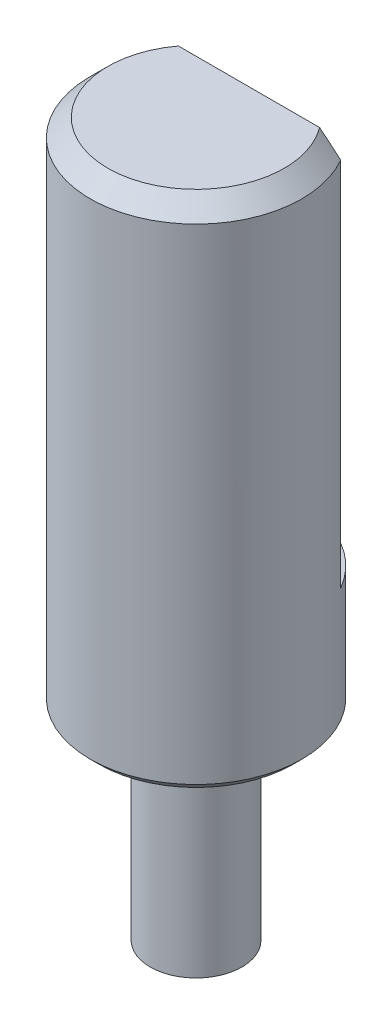
ISO-10303-21;
HEADER;
FILE_DESCRIPTION(('STEP AP214'),'2;1');
FILE_NAME('part.step','',(''),(''),'','','');
FILE_SCHEMA(('AUTOMOTIVE_DESIGN { 1 0 10303 214 1 1 1 1 }'));
ENDSEC;
DATA;
#1=APPLICATION_CONTEXT('core data for automotive mechanical design processes');
#2=APPLICATION_PROTOCOL_DEFINITION('international standard','automotive_design',2000,#1);
#3=PRODUCT_CONTEXT('',#1,'mechanical');
#4=PRODUCT('Part','Part','',(#3));
#5=PRODUCT_RELATED_PRODUCT_CATEGORY('part','',(#4));
#6=PRODUCT_DEFINITION_FORMATION('','',#4);
#7=PRODUCT_DEFINITION_CONTEXT('part definition',#1,'design');
#8=PRODUCT_DEFINITION('design','',#6,#7);
#9=PRODUCT_DEFINITION_SHAPE('','',#8);
#10=(LENGTH_UNIT() NAMED_UNIT(*) SI_UNIT(.MILLI.,.METRE.));
#11=(NAMED_UNIT(*) PLANE_ANGLE_UNIT() SI_UNIT($,.RADIAN.));
#12=(NAMED_UNIT(*) SI_UNIT($,.STERADIAN.) SOLID_ANGLE_UNIT());
#13=UNCERTAINTY_MEASURE_WITH_UNIT(LENGTH_MEASURE(1.E-05),#10,'distance_accuracy_value','');
#14=(GEOMETRIC_REPRESENTATION_CONTEXT(3) GLOBAL_UNCERTAINTY_ASSIGNED_CONTEXT((#13)) GLOBAL_UNIT_ASSIGNED_CONTEXT((#10,
#11,#12)) REPRESENTATION_CONTEXT('',''));
#15=CARTESIAN_POINT('',(0.,0.,0.));
#16=DIRECTION('',(0.,0.,1.));
#17=DIRECTION('',(1.,0.,0.));
#18=AXIS2_PLACEMENT_3D('',#15,#16,#17);
#19=CARTESIAN_POINT('',(0.,5.7,0.));
#20=DIRECTION('',(0.,-1.,0.));
#21=DIRECTION('',(0.,0.,-1.));
#22=AXIS2_PLACEMENT_3D('',#19,#20,#21);
#23=CYLINDRICAL_SURFACE('',#22,1.3);
#24=CARTESIAN_POINT('',(0.,5.7,0.));
#25=DIRECTION('',(0.,1.,0.));
#26=DIRECTION('',(0.,0.,1.));
#27=AXIS2_PLACEMENT_3D('',#24,#25,#26);
#28=CIRCLE('',#27,1.3);
#29=CARTESIAN_POINT('',(0.,5.7,1.3));
#30=VERTEX_POINT('',#29);
#31=EDGE_CURVE('E86',#30,#30,#28,.T.);
#32=ORIENTED_EDGE('',*,*,#31,.F.);
#33=EDGE_LOOP('',(#32));
#34=FACE_BOUND('',#33,.T.);
#35=CARTESIAN_POINT('',(0.,0.,0.));
#36=DIRECTION('',(0.,1.,0.));
#37=DIRECTION('',(0.,0.,1.));
#38=AXIS2_PLACEMENT_3D('',#35,#36,#37);
#39=CIRCLE('',#38,1.3);
#40=CARTESIAN_POINT('',(0.,0.,1.3));
#41=VERTEX_POINT('',#40);
#42=EDGE_CURVE('E82',#41,#41,#39,.T.);
#43=ORIENTED_EDGE('',*,*,#42,.T.);
#44=EDGE_LOOP('',(#43));
#45=FACE_BOUND('',#44,.T.);
#46=ADVANCED_FACE('F34',(#34,#45),#23,.T.);
#47=CARTESIAN_POINT('',(0.,0.,0.));
#48=DIRECTION('',(0.,1.,0.));
#49=DIRECTION('',(0.,0.,1.));
#50=AXIS2_PLACEMENT_3D('',#47,#48,#49);
#51=PLANE('',#50);
#52=ORIENTED_EDGE('',*,*,#42,.F.);
#53=EDGE_LOOP('',(#52));
#54=FACE_BOUND('',#53,.T.);
#55=ADVANCED_FACE('F126',(#54),#51,.F.);
#56=CARTESIAN_POINT('',(0.,20.2,0.));
#57=DIRECTION('',(0.,-1.,0.));
#58=DIRECTION('',(0.,0.,-1.));
#59=AXIS2_PLACEMENT_3D('',#56,#57,#58);
#60=CYLINDRICAL_SURFACE('',#59,3.);
#61=DIRECTION('',(0.,1.,0.));
#62=VECTOR('',#61,1.);
#63=CARTESIAN_POINT('',(2.59807621135332,9.2,-1.5));
#64=LINE('',#63,#62);
#65=CARTESIAN_POINT('',(2.59807621135332,9.2,-1.5));
#66=VERTEX_POINT('',#65);
#67=CARTESIAN_POINT('',(2.59807621135332,19.7,-1.5));
#68=VERTEX_POINT('',#67);
#69=EDGE_CURVE('E77',#66,#68,#64,.T.);
#70=ORIENTED_EDGE('',*,*,#69,.T.);
#71=CARTESIAN_POINT('',(0.,19.7,0.));
#72=DIRECTION('',(0.,1.,0.));
#73=DIRECTION('',(0.,0.,1.));
#74=AXIS2_PLACEMENT_3D('',#71,#72,#73);
#75=CIRCLE('',#74,3.);
#76=CARTESIAN_POINT('',(-2.59807621135332,19.7,-1.5));
#77=VERTEX_POINT('',#76);
#78=EDGE_CURVE('E11',#68,#77,#75,.F.);
#79=ORIENTED_EDGE('',*,*,#78,.T.);
#80=DIRECTION('',(0.,1.,0.));
#81=VECTOR('',#80,1.);
#82=CARTESIAN_POINT('',(-2.59807621135332,9.2,-1.5));
#83=LINE('',#82,#81);
#84=CARTESIAN_POINT('',(-2.59807621135332,9.2,-1.5));
#85=VERTEX_POINT('',#84);
#86=EDGE_CURVE('E75',#85,#77,#83,.T.);
#87=ORIENTED_EDGE('',*,*,#86,.F.);
#88=CARTESIAN_POINT('',(0.,9.2,0.));
#89=DIRECTION('',(0.,1.,0.));
#90=DIRECTION('',(0.,0.,1.));
#91=AXIS2_PLACEMENT_3D('',#88,#89,#90);
#92=CIRCLE('',#91,3.);
#93=EDGE_CURVE('E68',#66,#85,#92,.T.);
#94=ORIENTED_EDGE('',*,*,#93,.F.);
#95=EDGE_LOOP('',(#70,#79,#87,#94));
#96=FACE_BOUND('',#95,.T.);
#97=CARTESIAN_POINT('',(0.,5.95000000000001,0.));
#98=DIRECTION('',(0.,1.,0.));
#99=DIRECTION('',(0.,0.,1.));
#100=AXIS2_PLACEMENT_3D('',#97,#98,#99);
#101=CIRCLE('',#100,3.);
#102=CARTESIAN_POINT('',(0.,5.95000000000001,3.));
#103=VERTEX_POINT('',#102);
#104=EDGE_CURVE('E89',#103,#103,#101,.T.);
#105=ORIENTED_EDGE('',*,*,#104,.T.);
#106=EDGE_LOOP('',(#105));
#107=FACE_BOUND('',#106,.T.);
#108=ADVANCED_FACE('F79',(#96,#107),#60,.T.);
#109=CARTESIAN_POINT('',(0.,20.2,0.));
#110=DIRECTION('',(0.,1.,0.));
#111=DIRECTION('',(0.,0.,1.));
#112=AXIS2_PLACEMENT_3D('',#109,#110,#111);
#113=PLANE('',#112);
#114=DIRECTION('',(1.,0.,0.));
#115=VECTOR('',#114,1.);
#116=CARTESIAN_POINT('',(-2.59807621135332,20.2,-1.5));
#117=LINE('',#116,#115);
#118=CARTESIAN_POINT('',(-2.00000000000001,20.2,-1.5));
#119=VERTEX_POINT('',#118);
#120=CARTESIAN_POINT('',(2.00000000000001,20.2,-1.5));
#121=VERTEX_POINT('',#120);
#122=EDGE_CURVE('E72',#119,#121,#117,.T.);
#123=ORIENTED_EDGE('',*,*,#122,.F.);
#124=CARTESIAN_POINT('',(0.,20.2,0.));
#125=DIRECTION('',(0.,1.,0.));
#126=DIRECTION('',(0.,0.,1.));
#127=AXIS2_PLACEMENT_3D('',#124,#125,#126);
#128=CIRCLE('',#127,2.50000000000001);
#129=EDGE_CURVE('E97',#119,#121,#128,.T.);
#130=ORIENTED_EDGE('',*,*,#129,.T.);
#131=EDGE_LOOP('',(#123,#130));
#132=FACE_BOUND('',#131,.T.);
#133=ADVANCED_FACE('F115',(#132),#113,.T.);
#134=CARTESIAN_POINT('',(0.,5.7,0.));
#135=DIRECTION('',(0.,1.,0.));
#136=DIRECTION('',(0.,0.,1.));
#137=AXIS2_PLACEMENT_3D('',#134,#135,#136);
#138=PLANE('',#137);
#139=CARTESIAN_POINT('',(0.,5.7,0.));
#140=DIRECTION('',(0.,1.,0.));
#141=DIRECTION('',(0.,0.,1.));
#142=AXIS2_PLACEMENT_3D('',#139,#140,#141);
#143=CIRCLE('',#142,2.74999999999999);
#144=CARTESIAN_POINT('',(0.,5.7,2.74999999999999));
#145=VERTEX_POINT('',#144);
#146=EDGE_CURVE('E94',#145,#145,#143,.F.);
#147=ORIENTED_EDGE('',*,*,#146,.T.);
#148=EDGE_LOOP('',(#147));
#149=FACE_BOUND('',#148,.T.);
#150=ORIENTED_EDGE('',*,*,#31,.T.);
#151=EDGE_LOOP('',(#150));
#152=FACE_BOUND('',#151,.T.);
#153=ADVANCED_FACE('F119',(#149,#152),#138,.F.);
#154=CARTESIAN_POINT('',(0.,5.95000000000001,0.));
#155=DIRECTION('',(0.,1.,0.));
#156=DIRECTION('',(0.,0.,1.));
#157=AXIS2_PLACEMENT_3D('',#154,#155,#156);
#158=CONICAL_SURFACE('',#157,3.,0.785398163397448);
#159=ORIENTED_EDGE('',*,*,#146,.F.);
#160=EDGE_LOOP('',(#159));
#161=FACE_BOUND('',#160,.T.);
#162=ORIENTED_EDGE('',*,*,#104,.F.);
#163=EDGE_LOOP('',(#162));
#164=FACE_BOUND('',#163,.T.);
#165=ADVANCED_FACE('F114',(#161,#164),#158,.T.);
#166=CARTESIAN_POINT('',(-2.59807621135332,9.2,-1.5));
#167=DIRECTION('',(0.,0.,1.));
#168=DIRECTION('',(1.,0.,0.));
#169=AXIS2_PLACEMENT_3D('',#166,#167,#168);
#170=PLANE('',#169);
#171=ORIENTED_EDGE('',*,*,#122,.T.);
#172=CARTESIAN_POINT('',(2.00000000000001,20.2,-1.5));
#173=CARTESIAN_POINT('',(2.05073096834371,20.1594091541126,-1.5));
#174=CARTESIAN_POINT('',(2.10119559346293,20.1184877796223,-1.5));
#175=CARTESIAN_POINT('',(2.20165596476533,20.0360826364181,-1.5));
#176=CARTESIAN_POINT('',(2.25165175427951,19.9945989205613,-1.5));
#177=CARTESIAN_POINT('',(2.35124649520412,19.9111611597559,-1.5));
#178=CARTESIAN_POINT('',(2.40084545624944,19.8692071262861,-1.5));
#179=CARTESIAN_POINT('',(2.49970382878964,19.7848914399475,-1.5));
#180=CARTESIAN_POINT('',(2.54896320821956,19.7425297494666,-1.5));
#181=CARTESIAN_POINT('',(2.59807621135341,19.7000000000001,-1.5));
#182=B_SPLINE_CURVE_WITH_KNOTS('',3,(#172,#173,#174,#175,#176,#177,#178,#179,#180,#181),
.UNSPECIFIED.,.F.,.F.,(4,2,2,2,4),(0.,0.194909899355778,0.38980160348904,0.584688561258781,
0.779593675856239),.UNSPECIFIED.);
#183=EDGE_CURVE('E43',#121,#68,#182,.T.);
#184=ORIENTED_EDGE('',*,*,#183,.T.);
#185=ORIENTED_EDGE('',*,*,#69,.F.);
#186=DIRECTION('',(1.,0.,0.));
#187=VECTOR('',#186,1.);
#188=CARTESIAN_POINT('',(-2.59807621135332,9.2,-1.5));
#189=LINE('',#188,#187);
#190=EDGE_CURVE('E71',#85,#66,#189,.T.);
#191=ORIENTED_EDGE('',*,*,#190,.F.);
#192=ORIENTED_EDGE('',*,*,#86,.T.);
#193=CARTESIAN_POINT('',(-2.59807621135332,19.7,-1.5));
#194=CARTESIAN_POINT('',(-2.54896320821952,19.7425297494665,-1.5));
#195=CARTESIAN_POINT('',(-2.49970382878963,19.7848914399475,-1.5));
#196=CARTESIAN_POINT('',(-2.40084545624945,19.8692071262861,-1.5));
#197=CARTESIAN_POINT('',(-2.35124649520413,19.9111611597559,-1.5));
#198=CARTESIAN_POINT('',(-2.2516517542795,19.9945989205613,-1.5));
#199=CARTESIAN_POINT('',(-2.20165596476531,20.036082636418,-1.5));
#200=CARTESIAN_POINT('',(-2.10119559346297,20.1184877796224,-1.5));
#201=CARTESIAN_POINT('',(-2.05073096834384,20.1594091541128,-1.5));
#202=CARTESIAN_POINT('',(-2.00000000000032,20.2000000000004,-1.5));
#203=B_SPLINE_CURVE_WITH_KNOTS('',3,(#193,#194,#195,#196,#197,#198,#199,#200,#201,#202),
.UNSPECIFIED.,.F.,.F.,(4,2,2,2,4),(0.,0.194905114597462,0.389792072367198,0.584683776500454,
0.779593675856229),.UNSPECIFIED.);
#204=EDGE_CURVE('E100',#77,#119,#203,.T.);
#205=ORIENTED_EDGE('',*,*,#204,.T.);
#206=EDGE_LOOP('',(#171,#184,#185,#191,#192,#205));
#207=FACE_BOUND('',#206,.T.);
#208=ADVANCED_FACE('F74',(#207),#170,.F.);
#209=CARTESIAN_POINT('',(0.,9.2,0.));
#210=DIRECTION('',(0.,1.,0.));
#211=DIRECTION('',(0.,0.,1.));
#212=AXIS2_PLACEMENT_3D('',#209,#210,#211);
#213=PLANE('',#212);
#214=ORIENTED_EDGE('',*,*,#93,.T.);
#215=ORIENTED_EDGE('',*,*,#190,.T.);
#216=EDGE_LOOP('',(#214,#215));
#217=FACE_BOUND('',#216,.T.);
#218=ADVANCED_FACE('F70',(#217),#213,.T.);
#219=CARTESIAN_POINT('',(0.,20.2,0.));
#220=DIRECTION('',(0.,-1.,0.));
#221=DIRECTION('',(0.,0.,-1.));
#222=AXIS2_PLACEMENT_3D('',#219,#220,#221);
#223=CONICAL_SURFACE('',#222,2.50000000000001,0.785398163397447);
#224=ORIENTED_EDGE('',*,*,#204,.F.);
#225=ORIENTED_EDGE('',*,*,#78,.F.);
#226=ORIENTED_EDGE('',*,*,#183,.F.);
#227=ORIENTED_EDGE('',*,*,#129,.F.);
#228=EDGE_LOOP('',(#224,#225,#226,#227));
#229=FACE_BOUND('',#228,.T.);
#230=ADVANCED_FACE('F36',(#229),#223,.T.);
#231=CLOSED_SHELL('',(#46,#55,#108,#133,#153,#165,#208,#218,#230));
#232=MANIFOLD_SOLID_BREP('B2',#231);
#233=ADVANCED_BREP_SHAPE_REPRESENTATION('',(#18,#232),#14);
#234=SHAPE_DEFINITION_REPRESENTATION(#9,#233);
ENDSEC;
END-ISO-10303-21;
